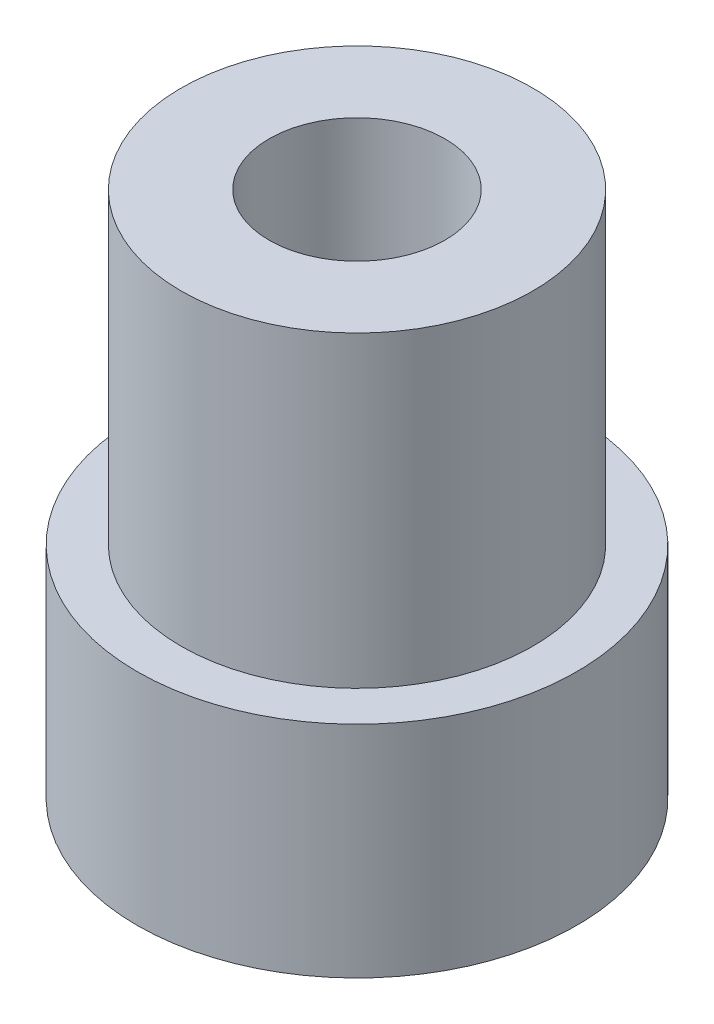
ISO-10303-21;
HEADER;
FILE_DESCRIPTION(('STEP AP214'),'2;1');
FILE_NAME('part.step','',(''),(''),'','','');
FILE_SCHEMA(('AUTOMOTIVE_DESIGN { 1 0 10303 214 1 1 1 1 }'));
ENDSEC;
DATA;
#1=APPLICATION_CONTEXT('core data for automotive mechanical design processes');
#2=APPLICATION_PROTOCOL_DEFINITION('international standard','automotive_design',2000,#1);
#3=PRODUCT_CONTEXT('',#1,'mechanical');
#4=PRODUCT('Part','Part','',(#3));
#5=PRODUCT_RELATED_PRODUCT_CATEGORY('part','',(#4));
#6=PRODUCT_DEFINITION_FORMATION('','',#4);
#7=PRODUCT_DEFINITION_CONTEXT('part definition',#1,'design');
#8=PRODUCT_DEFINITION('design','',#6,#7);
#9=PRODUCT_DEFINITION_SHAPE('','',#8);
#10=(LENGTH_UNIT() NAMED_UNIT(*) SI_UNIT(.MILLI.,.METRE.));
#11=(NAMED_UNIT(*) PLANE_ANGLE_UNIT() SI_UNIT($,.RADIAN.));
#12=(NAMED_UNIT(*) SI_UNIT($,.STERADIAN.) SOLID_ANGLE_UNIT());
#13=UNCERTAINTY_MEASURE_WITH_UNIT(LENGTH_MEASURE(1.E-05),#10,'distance_accuracy_value','');
#14=(GEOMETRIC_REPRESENTATION_CONTEXT(3) GLOBAL_UNCERTAINTY_ASSIGNED_CONTEXT((#13)) GLOBAL_UNIT_ASSIGNED_CONTEXT((#10,
#11,#12)) REPRESENTATION_CONTEXT('',''));
#15=CARTESIAN_POINT('',(0.,0.,0.));
#16=DIRECTION('',(0.,0.,1.));
#17=DIRECTION('',(1.,0.,0.));
#18=AXIS2_PLACEMENT_3D('',#15,#16,#17);
#19=CARTESIAN_POINT('',(0.,7.,0.));
#20=DIRECTION('',(0.,-1.,0.));
#21=DIRECTION('',(0.,0.,-1.));
#22=AXIS2_PLACEMENT_3D('',#19,#20,#21);
#23=CYLINDRICAL_SURFACE('',#22,4.);
#24=CARTESIAN_POINT('',(0.,7.,0.));
#25=DIRECTION('',(0.,1.,0.));
#26=DIRECTION('',(0.,0.,1.));
#27=AXIS2_PLACEMENT_3D('',#24,#25,#26);
#28=CIRCLE('',#27,4.);
#29=CARTESIAN_POINT('',(0.,7.,4.));
#30=VERTEX_POINT('',#29);
#31=EDGE_CURVE('E10',#30,#30,#28,.T.);
#32=ORIENTED_EDGE('',*,*,#31,.F.);
#33=EDGE_LOOP('',(#32));
#34=FACE_BOUND('',#33,.T.);
#35=CARTESIAN_POINT('',(0.,0.,0.));
#36=DIRECTION('',(0.,1.,0.));
#37=DIRECTION('',(0.,0.,1.));
#38=AXIS2_PLACEMENT_3D('',#35,#36,#37);
#39=CIRCLE('',#38,4.);
#40=CARTESIAN_POINT('',(0.,0.,4.));
#41=VERTEX_POINT('',#40);
#42=EDGE_CURVE('E51',#41,#41,#39,.T.);
#43=ORIENTED_EDGE('',*,*,#42,.T.);
#44=EDGE_LOOP('',(#43));
#45=FACE_BOUND('',#44,.T.);
#46=ADVANCED_FACE('F43',(#34,#45),#23,.T.);
#47=CARTESIAN_POINT('',(0.,7.,0.));
#48=DIRECTION('',(0.,1.,0.));
#49=DIRECTION('',(0.,0.,1.));
#50=AXIS2_PLACEMENT_3D('',#47,#48,#49);
#51=PLANE('',#50);
#52=CARTESIAN_POINT('',(0.,7.,0.));
#53=DIRECTION('',(0.,-1.,0.));
#54=DIRECTION('',(0.,0.,-1.));
#55=AXIS2_PLACEMENT_3D('',#52,#53,#54);
#56=CIRCLE('',#55,2.);
#57=CARTESIAN_POINT('',(0.,7.,-2.));
#58=VERTEX_POINT('',#57);
#59=EDGE_CURVE('E70',#58,#58,#56,.T.);
#60=ORIENTED_EDGE('',*,*,#59,.T.);
#61=EDGE_LOOP('',(#60));
#62=FACE_BOUND('',#61,.T.);
#63=ORIENTED_EDGE('',*,*,#31,.T.);
#64=EDGE_LOOP('',(#63));
#65=FACE_BOUND('',#64,.T.);
#66=ADVANCED_FACE('F99',(#62,#65),#51,.T.);
#67=CARTESIAN_POINT('',(0.,-5.,0.));
#68=DIRECTION('',(0.,1.,0.));
#69=DIRECTION('',(0.,0.,1.));
#70=AXIS2_PLACEMENT_3D('',#67,#68,#69);
#71=CYLINDRICAL_SURFACE('',#70,5.);
#72=CARTESIAN_POINT('',(0.,-5.,0.));
#73=DIRECTION('',(0.,-1.,0.));
#74=DIRECTION('',(0.,0.,-1.));
#75=AXIS2_PLACEMENT_3D('',#72,#73,#74);
#76=CIRCLE('',#75,5.);
#77=CARTESIAN_POINT('',(0.,-5.,-5.));
#78=VERTEX_POINT('',#77);
#79=EDGE_CURVE('E57',#78,#78,#76,.T.);
#80=ORIENTED_EDGE('',*,*,#79,.F.);
#81=EDGE_LOOP('',(#80));
#82=FACE_BOUND('',#81,.T.);
#83=CARTESIAN_POINT('',(0.,0.,0.));
#84=DIRECTION('',(0.,-1.,0.));
#85=DIRECTION('',(0.,0.,-1.));
#86=AXIS2_PLACEMENT_3D('',#83,#84,#85);
#87=CIRCLE('',#86,5.);
#88=CARTESIAN_POINT('',(0.,0.,-5.));
#89=VERTEX_POINT('',#88);
#90=EDGE_CURVE('E59',#89,#89,#87,.T.);
#91=ORIENTED_EDGE('',*,*,#90,.T.);
#92=EDGE_LOOP('',(#91));
#93=FACE_BOUND('',#92,.T.);
#94=ADVANCED_FACE('F104',(#82,#93),#71,.T.);
#95=CARTESIAN_POINT('',(0.,-5.,0.));
#96=DIRECTION('',(0.,-1.,0.));
#97=DIRECTION('',(0.,0.,-1.));
#98=AXIS2_PLACEMENT_3D('',#95,#96,#97);
#99=PLANE('',#98);
#100=CARTESIAN_POINT('',(0.,-5.,0.));
#101=DIRECTION('',(0.,-1.,0.));
#102=DIRECTION('',(0.,0.,-1.));
#103=AXIS2_PLACEMENT_3D('',#100,#101,#102);
#104=CIRCLE('',#103,1.65);
#105=CARTESIAN_POINT('',(0.,-5.,-1.65));
#106=VERTEX_POINT('',#105);
#107=EDGE_CURVE('E63',#106,#106,#104,.F.);
#108=ORIENTED_EDGE('',*,*,#107,.T.);
#109=EDGE_LOOP('',(#108));
#110=FACE_BOUND('',#109,.T.);
#111=ORIENTED_EDGE('',*,*,#79,.T.);
#112=EDGE_LOOP('',(#111));
#113=FACE_BOUND('',#112,.T.);
#114=ADVANCED_FACE('F111',(#110,#113),#99,.T.);
#115=CARTESIAN_POINT('',(0.,0.,0.));
#116=DIRECTION('',(0.,-1.,0.));
#117=DIRECTION('',(0.,0.,-1.));
#118=AXIS2_PLACEMENT_3D('',#115,#116,#117);
#119=PLANE('',#118);
#120=ORIENTED_EDGE('',*,*,#42,.F.);
#121=EDGE_LOOP('',(#120));
#122=FACE_BOUND('',#121,.T.);
#123=ORIENTED_EDGE('',*,*,#90,.F.);
#124=EDGE_LOOP('',(#123));
#125=FACE_BOUND('',#124,.T.);
#126=ADVANCED_FACE('F96',(#122,#125),#119,.F.);
#127=CARTESIAN_POINT('',(0.,-9.66690475583121,0.));
#128=DIRECTION('',(0.,1.,0.));
#129=DIRECTION('',(0.,0.,1.));
#130=AXIS2_PLACEMENT_3D('',#127,#128,#129);
#131=CYLINDRICAL_SURFACE('',#130,1.65);
#132=CARTESIAN_POINT('',(0.,2.,0.));
#133=DIRECTION('',(0.,-1.,0.));
#134=DIRECTION('',(0.,0.,-1.));
#135=AXIS2_PLACEMENT_3D('',#132,#133,#134);
#136=CIRCLE('',#135,1.65);
#137=CARTESIAN_POINT('',(0.,2.,-1.65));
#138=VERTEX_POINT('',#137);
#139=EDGE_CURVE('E46',#138,#138,#136,.F.);
#140=ORIENTED_EDGE('',*,*,#139,.T.);
#141=EDGE_LOOP('',(#140));
#142=FACE_BOUND('',#141,.T.);
#143=ORIENTED_EDGE('',*,*,#107,.F.);
#144=EDGE_LOOP('',(#143));
#145=FACE_BOUND('',#144,.T.);
#146=ADVANCED_FACE('F83',(#142,#145),#131,.F.);
#147=CARTESIAN_POINT('',(0.,2.,0.));
#148=DIRECTION('',(0.,-1.,0.));
#149=DIRECTION('',(0.,0.,-1.));
#150=AXIS2_PLACEMENT_3D('',#147,#148,#149);
#151=PLANE('',#150);
#152=CARTESIAN_POINT('',(0.,2.,0.));
#153=DIRECTION('',(0.,-1.,0.));
#154=DIRECTION('',(0.,0.,-1.));
#155=AXIS2_PLACEMENT_3D('',#152,#153,#154);
#156=CIRCLE('',#155,2.);
#157=CARTESIAN_POINT('',(0.,2.,-2.));
#158=VERTEX_POINT('',#157);
#159=EDGE_CURVE('E74',#158,#158,#156,.T.);
#160=ORIENTED_EDGE('',*,*,#159,.F.);
#161=EDGE_LOOP('',(#160));
#162=FACE_BOUND('',#161,.T.);
#163=ORIENTED_EDGE('',*,*,#139,.F.);
#164=EDGE_LOOP('',(#163));
#165=FACE_BOUND('',#164,.T.);
#166=ADVANCED_FACE('F86',(#162,#165),#151,.F.);
#167=CARTESIAN_POINT('',(0.,2.,0.));
#168=DIRECTION('',(0.,1.,0.));
#169=DIRECTION('',(0.,0.,1.));
#170=AXIS2_PLACEMENT_3D('',#167,#168,#169);
#171=CYLINDRICAL_SURFACE('',#170,2.);
#172=ORIENTED_EDGE('',*,*,#159,.T.);
#173=EDGE_LOOP('',(#172));
#174=FACE_BOUND('',#173,.T.);
#175=ORIENTED_EDGE('',*,*,#59,.F.);
#176=EDGE_LOOP('',(#175));
#177=FACE_BOUND('',#176,.T.);
#178=ADVANCED_FACE('F88',(#174,#177),#171,.F.);
#179=CLOSED_SHELL('',(#46,#66,#94,#114,#126,#146,#166,#178));
#180=MANIFOLD_SOLID_BREP('B2',#179);
#181=ADVANCED_BREP_SHAPE_REPRESENTATION('',(#18,#180),#14);
#182=SHAPE_DEFINITION_REPRESENTATION(#9,#181);
ENDSEC;
END-ISO-10303-21;
